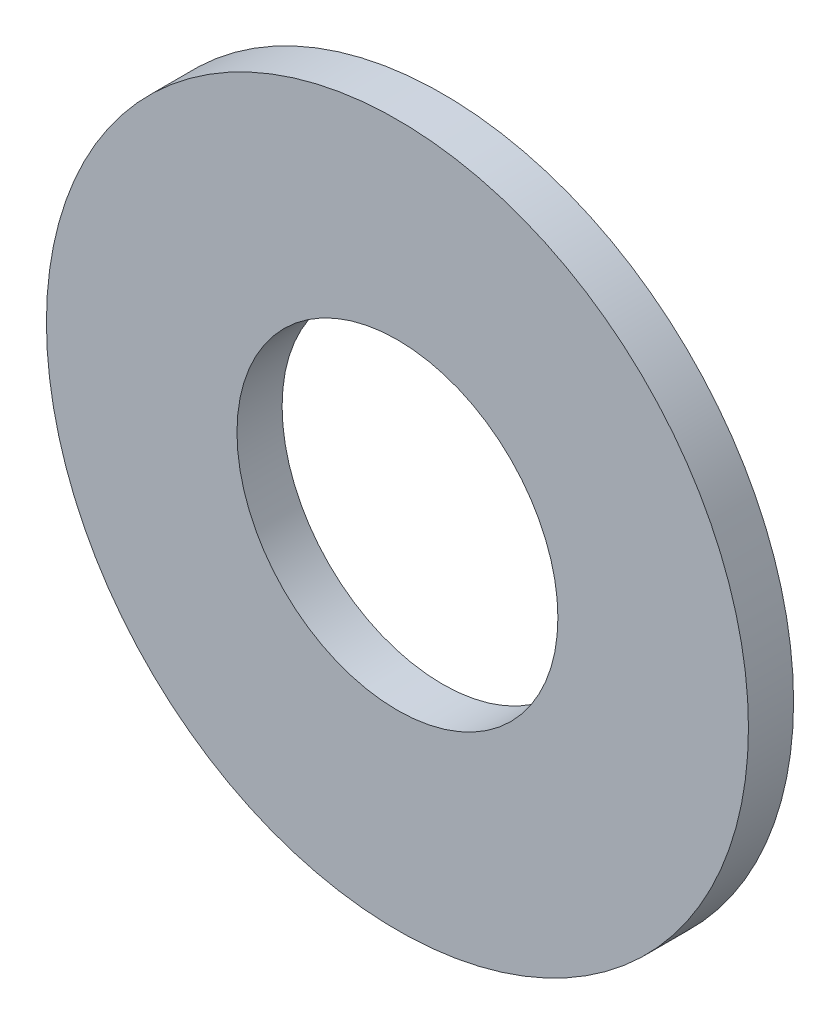
ISO-10303-21;
HEADER;
FILE_DESCRIPTION(('STEP AP214'),'2;1');
FILE_NAME('part.step','',(''),(''),'','','');
FILE_SCHEMA(('AUTOMOTIVE_DESIGN { 1 0 10303 214 1 1 1 1 }'));
ENDSEC;
DATA;
#1=APPLICATION_CONTEXT('core data for automotive mechanical design processes');
#2=APPLICATION_PROTOCOL_DEFINITION('international standard','automotive_design',2000,#1);
#3=PRODUCT_CONTEXT('',#1,'mechanical');
#4=PRODUCT('Part','Part','',(#3));
#5=PRODUCT_RELATED_PRODUCT_CATEGORY('part','',(#4));
#6=PRODUCT_DEFINITION_FORMATION('','',#4);
#7=PRODUCT_DEFINITION_CONTEXT('part definition',#1,'design');
#8=PRODUCT_DEFINITION('design','',#6,#7);
#9=PRODUCT_DEFINITION_SHAPE('','',#8);
#10=(LENGTH_UNIT() NAMED_UNIT(*) SI_UNIT(.MILLI.,.METRE.));
#11=(NAMED_UNIT(*) PLANE_ANGLE_UNIT() SI_UNIT($,.RADIAN.));
#12=(NAMED_UNIT(*) SI_UNIT($,.STERADIAN.) SOLID_ANGLE_UNIT());
#13=UNCERTAINTY_MEASURE_WITH_UNIT(LENGTH_MEASURE(1.E-05),#10,'distance_accuracy_value','');
#14=(GEOMETRIC_REPRESENTATION_CONTEXT(3) GLOBAL_UNCERTAINTY_ASSIGNED_CONTEXT((#13)) GLOBAL_UNIT_ASSIGNED_CONTEXT((#10,
#11,#12)) REPRESENTATION_CONTEXT('',''));
#15=CARTESIAN_POINT('',(0.,0.,0.));
#16=DIRECTION('',(0.,0.,1.));
#17=DIRECTION('',(1.,0.,0.));
#18=AXIS2_PLACEMENT_3D('',#15,#16,#17);
#19=CARTESIAN_POINT('',(0.,0.,0.));
#20=DIRECTION('',(0.,0.,1.));
#21=DIRECTION('',(1.,0.,0.));
#22=AXIS2_PLACEMENT_3D('',#19,#20,#21);
#23=PLANE('',#22);
#24=CARTESIAN_POINT('',(0.,0.,0.));
#25=DIRECTION('',(0.,0.,1.));
#26=DIRECTION('',(1.,0.,0.));
#27=AXIS2_PLACEMENT_3D('',#24,#25,#26);
#28=CIRCLE('',#27,1.6);
#29=CARTESIAN_POINT('',(1.6,0.,0.));
#30=VERTEX_POINT('',#29);
#31=EDGE_CURVE('E26',#30,#30,#28,.F.);
#32=ORIENTED_EDGE('',*,*,#31,.T.);
#33=EDGE_LOOP('',(#32));
#34=FACE_BOUND('',#33,.T.);
#35=CARTESIAN_POINT('',(0.,0.,0.));
#36=DIRECTION('',(0.,0.,1.));
#37=DIRECTION('',(1.,0.,0.));
#38=AXIS2_PLACEMENT_3D('',#35,#36,#37);
#39=CIRCLE('',#38,3.5);
#40=CARTESIAN_POINT('',(3.5,0.,0.));
#41=VERTEX_POINT('',#40);
#42=EDGE_CURVE('E17',#41,#41,#39,.F.);
#43=ORIENTED_EDGE('',*,*,#42,.F.);
#44=EDGE_LOOP('',(#43));
#45=FACE_BOUND('',#44,.T.);
#46=ADVANCED_FACE('F14',(#34,#45),#23,.T.);
#47=CARTESIAN_POINT('',(0.,0.,-0.45));
#48=DIRECTION('',(0.,0.,1.));
#49=DIRECTION('',(1.,0.,0.));
#50=AXIS2_PLACEMENT_3D('',#47,#48,#49);
#51=CYLINDRICAL_SURFACE('',#50,3.5);
#52=ORIENTED_EDGE('',*,*,#42,.T.);
#53=EDGE_LOOP('',(#52));
#54=FACE_BOUND('',#53,.T.);
#55=CARTESIAN_POINT('',(0.,0.,-0.45));
#56=DIRECTION('',(0.,0.,1.));
#57=DIRECTION('',(1.,0.,0.));
#58=AXIS2_PLACEMENT_3D('',#55,#56,#57);
#59=CIRCLE('',#58,3.5);
#60=CARTESIAN_POINT('',(3.5,0.,-0.45));
#61=VERTEX_POINT('',#60);
#62=EDGE_CURVE('E21',#61,#61,#59,.T.);
#63=ORIENTED_EDGE('',*,*,#62,.T.);
#64=EDGE_LOOP('',(#63));
#65=FACE_BOUND('',#64,.T.);
#66=ADVANCED_FACE('F34',(#54,#65),#51,.T.);
#67=CARTESIAN_POINT('',(0.,0.,-0.45));
#68=DIRECTION('',(0.,0.,1.));
#69=DIRECTION('',(1.,0.,0.));
#70=AXIS2_PLACEMENT_3D('',#67,#68,#69);
#71=CYLINDRICAL_SURFACE('',#70,1.6);
#72=ORIENTED_EDGE('',*,*,#31,.F.);
#73=EDGE_LOOP('',(#72));
#74=FACE_BOUND('',#73,.T.);
#75=CARTESIAN_POINT('',(0.,0.,-0.45));
#76=DIRECTION('',(0.,0.,1.));
#77=DIRECTION('',(1.,0.,0.));
#78=AXIS2_PLACEMENT_3D('',#75,#76,#77);
#79=CIRCLE('',#78,1.6);
#80=CARTESIAN_POINT('',(1.6,0.,-0.45));
#81=VERTEX_POINT('',#80);
#82=EDGE_CURVE('E10',#81,#81,#79,.F.);
#83=ORIENTED_EDGE('',*,*,#82,.T.);
#84=EDGE_LOOP('',(#83));
#85=FACE_BOUND('',#84,.T.);
#86=ADVANCED_FACE('F42',(#74,#85),#71,.F.);
#87=CARTESIAN_POINT('',(0.,0.,-0.45));
#88=DIRECTION('',(0.,0.,1.));
#89=DIRECTION('',(1.,0.,0.));
#90=AXIS2_PLACEMENT_3D('',#87,#88,#89);
#91=PLANE('',#90);
#92=ORIENTED_EDGE('',*,*,#82,.F.);
#93=EDGE_LOOP('',(#92));
#94=FACE_BOUND('',#93,.T.);
#95=ORIENTED_EDGE('',*,*,#62,.F.);
#96=EDGE_LOOP('',(#95));
#97=FACE_BOUND('',#96,.T.);
#98=ADVANCED_FACE('F43',(#94,#97),#91,.F.);
#99=CLOSED_SHELL('',(#46,#66,#86,#98));
#100=MANIFOLD_SOLID_BREP('B1',#99);
#101=ADVANCED_BREP_SHAPE_REPRESENTATION('',(#18,#100),#14);
#102=SHAPE_DEFINITION_REPRESENTATION(#9,#101);
ENDSEC;
END-ISO-10303-21;
